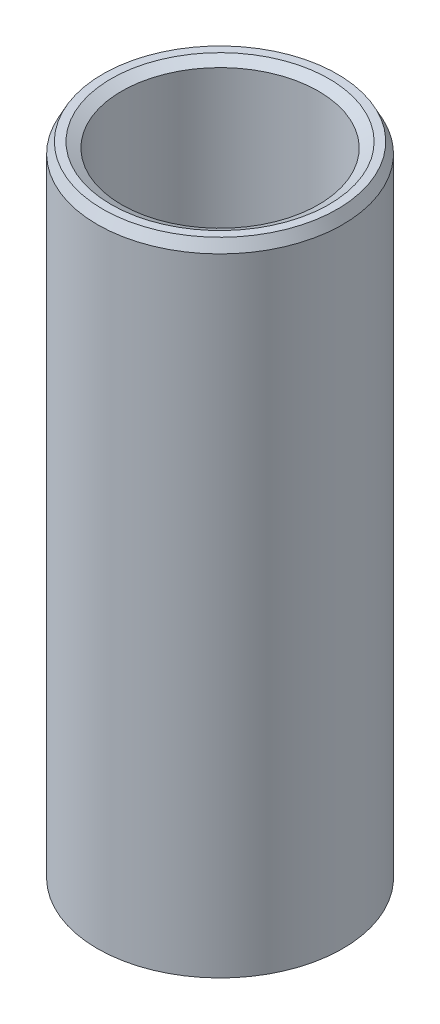
ISO-10303-21;
HEADER;
FILE_DESCRIPTION(('STEP AP214'),'2;1');
FILE_NAME('part.step','',(''),(''),'','','');
FILE_SCHEMA(('AUTOMOTIVE_DESIGN { 1 0 10303 214 1 1 1 1 }'));
ENDSEC;
DATA;
#1=APPLICATION_CONTEXT('core data for automotive mechanical design processes');
#2=APPLICATION_PROTOCOL_DEFINITION('international standard','automotive_design',2000,#1);
#3=PRODUCT_CONTEXT('',#1,'mechanical');
#4=PRODUCT('Part','Part','',(#3));
#5=PRODUCT_RELATED_PRODUCT_CATEGORY('part','',(#4));
#6=PRODUCT_DEFINITION_FORMATION('','',#4);
#7=PRODUCT_DEFINITION_CONTEXT('part definition',#1,'design');
#8=PRODUCT_DEFINITION('design','',#6,#7);
#9=PRODUCT_DEFINITION_SHAPE('','',#8);
#10=(LENGTH_UNIT() NAMED_UNIT(*) SI_UNIT(.MILLI.,.METRE.));
#11=(NAMED_UNIT(*) PLANE_ANGLE_UNIT() SI_UNIT($,.RADIAN.));
#12=(NAMED_UNIT(*) SI_UNIT($,.STERADIAN.) SOLID_ANGLE_UNIT());
#13=UNCERTAINTY_MEASURE_WITH_UNIT(LENGTH_MEASURE(1.E-05),#10,'distance_accuracy_value','');
#14=(GEOMETRIC_REPRESENTATION_CONTEXT(3) GLOBAL_UNCERTAINTY_ASSIGNED_CONTEXT((#13)) GLOBAL_UNIT_ASSIGNED_CONTEXT((#10,
#11,#12)) REPRESENTATION_CONTEXT('',''));
#15=CARTESIAN_POINT('',(0.,0.,0.));
#16=DIRECTION('',(0.,0.,1.));
#17=DIRECTION('',(1.,0.,0.));
#18=AXIS2_PLACEMENT_3D('',#15,#16,#17);
#19=CARTESIAN_POINT('',(0.,170.396110979487,0.));
#20=DIRECTION('',(0.,-1.,0.));
#21=DIRECTION('',(0.,0.,-1.));
#22=AXIS2_PLACEMENT_3D('',#19,#20,#21);
#23=CYLINDRICAL_SURFACE('',#22,32.5);
#24=CARTESIAN_POINT('',(0.,1.44988206018024,0.));
#25=DIRECTION('',(0.,1.,0.));
#26=DIRECTION('',(0.,0.,1.));
#27=AXIS2_PLACEMENT_3D('',#24,#25,#26);
#28=CIRCLE('',#27,32.5);
#29=CARTESIAN_POINT('',(0.,1.44988206018024,32.5));
#30=VERTEX_POINT('',#29);
#31=EDGE_CURVE('E10',#30,#30,#28,.T.);
#32=ORIENTED_EDGE('',*,*,#31,.T.);
#33=EDGE_LOOP('',(#32));
#34=FACE_BOUND('',#33,.T.);
#35=CARTESIAN_POINT('',(0.,167.601146025154,0.));
#36=DIRECTION('',(0.,1.,0.));
#37=DIRECTION('',(0.,0.,1.));
#38=AXIS2_PLACEMENT_3D('',#35,#36,#37);
#39=CIRCLE('',#38,32.5);
#40=CARTESIAN_POINT('',(0.,167.601146025154,32.5));
#41=VERTEX_POINT('',#40);
#42=EDGE_CURVE('E50',#41,#41,#39,.F.);
#43=ORIENTED_EDGE('',*,*,#42,.T.);
#44=EDGE_LOOP('',(#43));
#45=FACE_BOUND('',#44,.T.);
#46=ADVANCED_FACE('F39',(#34,#45),#23,.T.);
#47=CARTESIAN_POINT('',(0.,170.396110979487,0.));
#48=DIRECTION('',(0.,1.,0.));
#49=DIRECTION('',(0.,0.,1.));
#50=AXIS2_PLACEMENT_3D('',#47,#48,#49);
#51=PLANE('',#50);
#52=CARTESIAN_POINT('',(0.,170.396110979487,0.));
#53=DIRECTION('',(0.,1.,0.));
#54=DIRECTION('',(0.,0.,1.));
#55=AXIS2_PLACEMENT_3D('',#52,#53,#54);
#56=CIRCLE('',#55,28.872033261653);
#57=CARTESIAN_POINT('',(0.,170.396110979487,28.872033261653));
#58=VERTEX_POINT('',#57);
#59=EDGE_CURVE('E58',#58,#58,#56,.F.);
#60=ORIENTED_EDGE('',*,*,#59,.T.);
#61=EDGE_LOOP('',(#60));
#62=FACE_BOUND('',#61,.T.);
#63=CARTESIAN_POINT('',(0.,170.396110979487,0.));
#64=DIRECTION('',(0.,1.,0.));
#65=DIRECTION('',(0.,0.,1.));
#66=AXIS2_PLACEMENT_3D('',#63,#64,#65);
#67=CIRCLE('',#66,31.0501179398198);
#68=CARTESIAN_POINT('',(0.,170.396110979487,31.0501179398198));
#69=VERTEX_POINT('',#68);
#70=EDGE_CURVE('E61',#69,#69,#67,.T.);
#71=ORIENTED_EDGE('',*,*,#70,.T.);
#72=EDGE_LOOP('',(#71));
#73=FACE_BOUND('',#72,.T.);
#74=ADVANCED_FACE('F88',(#62,#73),#51,.T.);
#75=CARTESIAN_POINT('',(0.,0.,0.));
#76=DIRECTION('',(0.,1.,0.));
#77=DIRECTION('',(0.,0.,1.));
#78=AXIS2_PLACEMENT_3D('',#75,#76,#77);
#79=PLANE('',#78);
#80=CARTESIAN_POINT('',(0.,0.,0.));
#81=DIRECTION('',(0.,1.,0.));
#82=DIRECTION('',(0.,0.,1.));
#83=AXIS2_PLACEMENT_3D('',#80,#81,#82);
#84=CIRCLE('',#83,27.5269503675001);
#85=CARTESIAN_POINT('',(0.,0.,27.5269503675001));
#86=VERTEX_POINT('',#85);
#87=EDGE_CURVE('E51',#86,#86,#84,.T.);
#88=ORIENTED_EDGE('',*,*,#87,.T.);
#89=EDGE_LOOP('',(#88));
#90=FACE_BOUND('',#89,.T.);
#91=CARTESIAN_POINT('',(0.,0.,0.));
#92=DIRECTION('',(0.,1.,0.));
#93=DIRECTION('',(0.,0.,1.));
#94=AXIS2_PLACEMENT_3D('',#91,#92,#93);
#95=CIRCLE('',#94,29.705035045667);
#96=CARTESIAN_POINT('',(0.,0.,29.705035045667));
#97=VERTEX_POINT('',#96);
#98=EDGE_CURVE('E54',#97,#97,#95,.F.);
#99=ORIENTED_EDGE('',*,*,#98,.T.);
#100=EDGE_LOOP('',(#99));
#101=FACE_BOUND('',#100,.T.);
#102=ADVANCED_FACE('F83',(#90,#101),#79,.F.);
#103=CARTESIAN_POINT('',(0.,170.396110979487,0.));
#104=DIRECTION('',(0.,-1.,0.));
#105=DIRECTION('',(0.,0.,-1.));
#106=AXIS2_PLACEMENT_3D('',#103,#104,#105);
#107=CYLINDRICAL_SURFACE('',#106,26.07706830732);
#108=CARTESIAN_POINT('',(0.,168.946228919306,0.));
#109=DIRECTION('',(0.,1.,0.));
#110=DIRECTION('',(0.,0.,1.));
#111=AXIS2_PLACEMENT_3D('',#108,#109,#110);
#112=CIRCLE('',#111,26.07706830732);
#113=CARTESIAN_POINT('',(0.,168.946228919306,26.07706830732));
#114=VERTEX_POINT('',#113);
#115=EDGE_CURVE('E67',#114,#114,#112,.T.);
#116=ORIENTED_EDGE('',*,*,#115,.T.);
#117=EDGE_LOOP('',(#116));
#118=FACE_BOUND('',#117,.T.);
#119=CARTESIAN_POINT('',(0.,2.79496495433293,0.));
#120=DIRECTION('',(0.,1.,0.));
#121=DIRECTION('',(0.,0.,1.));
#122=AXIS2_PLACEMENT_3D('',#119,#120,#121);
#123=CIRCLE('',#122,26.07706830732);
#124=CARTESIAN_POINT('',(0.,2.79496495433293,26.07706830732));
#125=VERTEX_POINT('',#124);
#126=EDGE_CURVE('E69',#125,#125,#123,.F.);
#127=ORIENTED_EDGE('',*,*,#126,.T.);
#128=EDGE_LOOP('',(#127));
#129=FACE_BOUND('',#128,.T.);
#130=ADVANCED_FACE('F71',(#118,#129),#107,.F.);
#131=CARTESIAN_POINT('',(0.,168.946228919306,0.));
#132=DIRECTION('',(0.,1.,0.));
#133=DIRECTION('',(0.,0.,1.));
#134=AXIS2_PLACEMENT_3D('',#131,#132,#133);
#135=CONICAL_SURFACE('',#134,26.07706830732,1.09226317455352);
#136=ORIENTED_EDGE('',*,*,#59,.F.);
#137=EDGE_LOOP('',(#136));
#138=FACE_BOUND('',#137,.T.);
#139=ORIENTED_EDGE('',*,*,#115,.F.);
#140=EDGE_LOOP('',(#139));
#141=FACE_BOUND('',#140,.T.);
#142=ADVANCED_FACE('F77',(#138,#141),#135,.F.);
#143=CARTESIAN_POINT('',(0.,0.,0.));
#144=DIRECTION('',(0.,-1.,0.));
#145=DIRECTION('',(0.,0.,-1.));
#146=AXIS2_PLACEMENT_3D('',#143,#144,#145);
#147=CONICAL_SURFACE('',#146,27.5269503675001,0.478533152241377);
#148=ORIENTED_EDGE('',*,*,#126,.F.);
#149=EDGE_LOOP('',(#148));
#150=FACE_BOUND('',#149,.T.);
#151=ORIENTED_EDGE('',*,*,#87,.F.);
#152=EDGE_LOOP('',(#151));
#153=FACE_BOUND('',#152,.T.);
#154=ADVANCED_FACE('F73',(#150,#153),#147,.F.);
#155=CARTESIAN_POINT('',(0.,1.44988206018024,0.));
#156=DIRECTION('',(0.,1.,0.));
#157=DIRECTION('',(0.,0.,1.));
#158=AXIS2_PLACEMENT_3D('',#155,#156,#157);
#159=CONICAL_SURFACE('',#158,32.5,1.09226317455352);
#160=ORIENTED_EDGE('',*,*,#98,.F.);
#161=EDGE_LOOP('',(#160));
#162=FACE_BOUND('',#161,.T.);
#163=ORIENTED_EDGE('',*,*,#31,.F.);
#164=EDGE_LOOP('',(#163));
#165=FACE_BOUND('',#164,.T.);
#166=ADVANCED_FACE('F76',(#162,#165),#159,.T.);
#167=CARTESIAN_POINT('',(0.,170.396110979487,0.));
#168=DIRECTION('',(0.,-1.,0.));
#169=DIRECTION('',(0.,0.,-1.));
#170=AXIS2_PLACEMENT_3D('',#167,#168,#169);
#171=CONICAL_SURFACE('',#170,31.0501179398198,0.478533152241378);
#172=ORIENTED_EDGE('',*,*,#42,.F.);
#173=EDGE_LOOP('',(#172));
#174=FACE_BOUND('',#173,.T.);
#175=ORIENTED_EDGE('',*,*,#70,.F.);
#176=EDGE_LOOP('',(#175));
#177=FACE_BOUND('',#176,.T.);
#178=ADVANCED_FACE('F45',(#174,#177),#171,.T.);
#179=CLOSED_SHELL('',(#46,#74,#102,#130,#142,#154,#166,#178));
#180=MANIFOLD_SOLID_BREP('B2',#179);
#181=ADVANCED_BREP_SHAPE_REPRESENTATION('',(#18,#180),#14);
#182=SHAPE_DEFINITION_REPRESENTATION(#9,#181);
ENDSEC;
END-ISO-10303-21;
